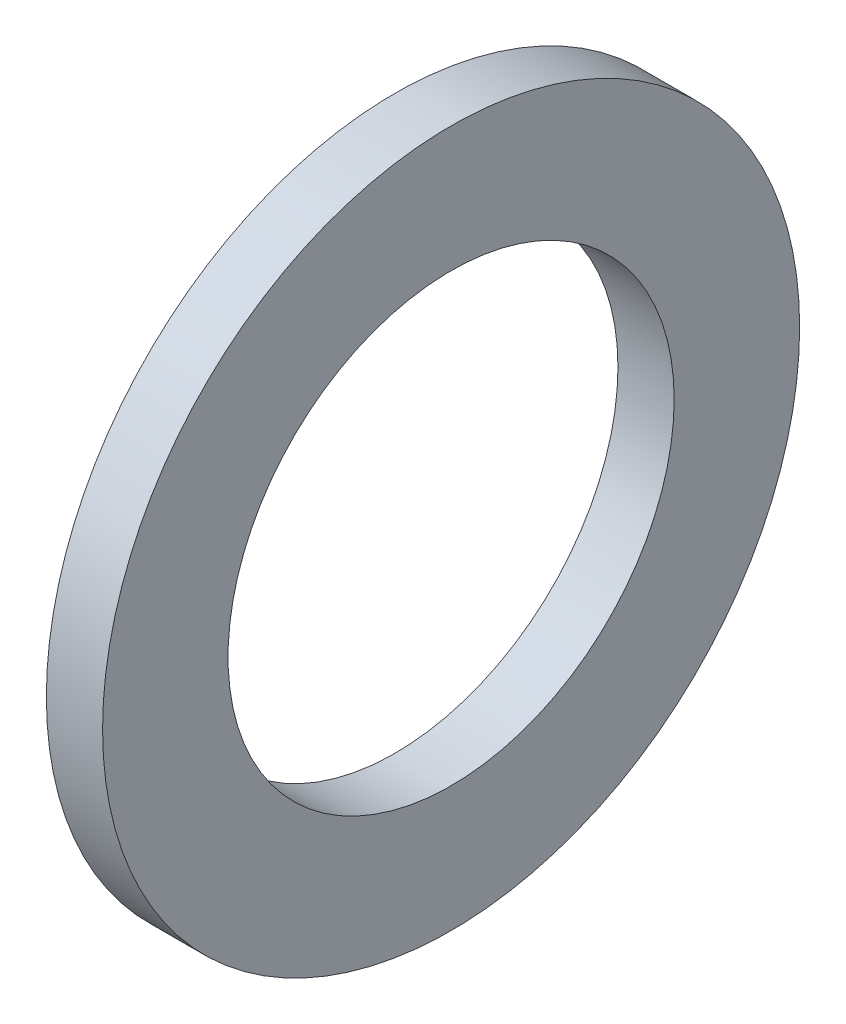
ISO-10303-21;
HEADER;
FILE_DESCRIPTION(('STEP AP214'),'2;1');
FILE_NAME('part.step','',(''),(''),'','','');
FILE_SCHEMA(('AUTOMOTIVE_DESIGN { 1 0 10303 214 1 1 1 1 }'));
ENDSEC;
DATA;
#1=APPLICATION_CONTEXT('core data for automotive mechanical design processes');
#2=APPLICATION_PROTOCOL_DEFINITION('international standard','automotive_design',2000,#1);
#3=PRODUCT_CONTEXT('',#1,'mechanical');
#4=PRODUCT('Part','Part','',(#3));
#5=PRODUCT_RELATED_PRODUCT_CATEGORY('part','',(#4));
#6=PRODUCT_DEFINITION_FORMATION('','',#4);
#7=PRODUCT_DEFINITION_CONTEXT('part definition',#1,'design');
#8=PRODUCT_DEFINITION('design','',#6,#7);
#9=PRODUCT_DEFINITION_SHAPE('','',#8);
#10=(LENGTH_UNIT() NAMED_UNIT(*) SI_UNIT(.MILLI.,.METRE.));
#11=(NAMED_UNIT(*) PLANE_ANGLE_UNIT() SI_UNIT($,.RADIAN.));
#12=(NAMED_UNIT(*) SI_UNIT($,.STERADIAN.) SOLID_ANGLE_UNIT());
#13=UNCERTAINTY_MEASURE_WITH_UNIT(LENGTH_MEASURE(1.E-05),#10,'distance_accuracy_value','');
#14=(GEOMETRIC_REPRESENTATION_CONTEXT(3) GLOBAL_UNCERTAINTY_ASSIGNED_CONTEXT((#13)) GLOBAL_UNIT_ASSIGNED_CONTEXT((#10,
#11,#12)) REPRESENTATION_CONTEXT('',''));
#15=CARTESIAN_POINT('',(0.,0.,0.));
#16=DIRECTION('',(0.,0.,1.));
#17=DIRECTION('',(1.,0.,0.));
#18=AXIS2_PLACEMENT_3D('',#15,#16,#17);
#19=CARTESIAN_POINT('',(3.2004,0.,0.));
#20=DIRECTION('',(1.,0.,0.));
#21=DIRECTION('',(0.,0.,-1.));
#22=AXIS2_PLACEMENT_3D('',#19,#20,#21);
#23=PLANE('',#22);
#24=CARTESIAN_POINT('',(3.2004,0.,0.));
#25=DIRECTION('',(1.,0.,0.));
#26=DIRECTION('',(0.,0.,-1.));
#27=AXIS2_PLACEMENT_3D('',#24,#25,#26);
#28=CIRCLE('',#27,19.84375);
#29=CARTESIAN_POINT('',(3.2004,0.,-19.84375));
#30=VERTEX_POINT('',#29);
#31=EDGE_CURVE('E10',#30,#30,#28,.T.);
#32=ORIENTED_EDGE('',*,*,#31,.T.);
#33=EDGE_LOOP('',(#32));
#34=FACE_BOUND('',#33,.T.);
#35=CARTESIAN_POINT('',(3.2004,0.,0.));
#36=DIRECTION('',(1.,0.,0.));
#37=DIRECTION('',(0.,0.,-1.));
#38=AXIS2_PLACEMENT_3D('',#35,#36,#37);
#39=CIRCLE('',#38,12.7);
#40=CARTESIAN_POINT('',(3.2004,0.,-12.7));
#41=VERTEX_POINT('',#40);
#42=EDGE_CURVE('E45',#41,#41,#39,.T.);
#43=ORIENTED_EDGE('',*,*,#42,.F.);
#44=EDGE_LOOP('',(#43));
#45=FACE_BOUND('',#44,.T.);
#46=ADVANCED_FACE('F34',(#34,#45),#23,.T.);
#47=CARTESIAN_POINT('',(0.,0.,0.));
#48=DIRECTION('',(1.,0.,0.));
#49=DIRECTION('',(0.,0.,-1.));
#50=AXIS2_PLACEMENT_3D('',#47,#48,#49);
#51=PLANE('',#50);
#52=CARTESIAN_POINT('',(0.,0.,0.));
#53=DIRECTION('',(1.,0.,0.));
#54=DIRECTION('',(0.,0.,-1.));
#55=AXIS2_PLACEMENT_3D('',#52,#53,#54);
#56=CIRCLE('',#55,19.84375);
#57=CARTESIAN_POINT('',(0.,0.,-19.84375));
#58=VERTEX_POINT('',#57);
#59=EDGE_CURVE('E41',#58,#58,#56,.T.);
#60=ORIENTED_EDGE('',*,*,#59,.F.);
#61=EDGE_LOOP('',(#60));
#62=FACE_BOUND('',#61,.T.);
#63=CARTESIAN_POINT('',(0.,0.,0.));
#64=DIRECTION('',(1.,0.,0.));
#65=DIRECTION('',(0.,0.,-1.));
#66=AXIS2_PLACEMENT_3D('',#63,#64,#65);
#67=CIRCLE('',#66,12.7);
#68=CARTESIAN_POINT('',(0.,0.,-12.7));
#69=VERTEX_POINT('',#68);
#70=EDGE_CURVE('E49',#69,#69,#67,.T.);
#71=ORIENTED_EDGE('',*,*,#70,.T.);
#72=EDGE_LOOP('',(#71));
#73=FACE_BOUND('',#72,.T.);
#74=ADVANCED_FACE('F55',(#62,#73),#51,.F.);
#75=CARTESIAN_POINT('',(3.2004,0.,0.));
#76=DIRECTION('',(-1.,0.,0.));
#77=DIRECTION('',(0.,0.,1.));
#78=AXIS2_PLACEMENT_3D('',#75,#76,#77);
#79=CYLINDRICAL_SURFACE('',#78,19.84375);
#80=ORIENTED_EDGE('',*,*,#31,.F.);
#81=EDGE_LOOP('',(#80));
#82=FACE_BOUND('',#81,.T.);
#83=ORIENTED_EDGE('',*,*,#59,.T.);
#84=EDGE_LOOP('',(#83));
#85=FACE_BOUND('',#84,.T.);
#86=ADVANCED_FACE('F36',(#82,#85),#79,.T.);
#87=CARTESIAN_POINT('',(3.2004,0.,0.));
#88=DIRECTION('',(-1.,0.,0.));
#89=DIRECTION('',(0.,0.,1.));
#90=AXIS2_PLACEMENT_3D('',#87,#88,#89);
#91=CYLINDRICAL_SURFACE('',#90,12.7);
#92=ORIENTED_EDGE('',*,*,#42,.T.);
#93=EDGE_LOOP('',(#92));
#94=FACE_BOUND('',#93,.T.);
#95=ORIENTED_EDGE('',*,*,#70,.F.);
#96=EDGE_LOOP('',(#95));
#97=FACE_BOUND('',#96,.T.);
#98=ADVANCED_FACE('F57',(#94,#97),#91,.F.);
#99=CLOSED_SHELL('',(#46,#74,#86,#98));
#100=MANIFOLD_SOLID_BREP('B2',#99);
#101=ADVANCED_BREP_SHAPE_REPRESENTATION('',(#18,#100),#14);
#102=SHAPE_DEFINITION_REPRESENTATION(#9,#101);
ENDSEC;
END-ISO-10303-21;
